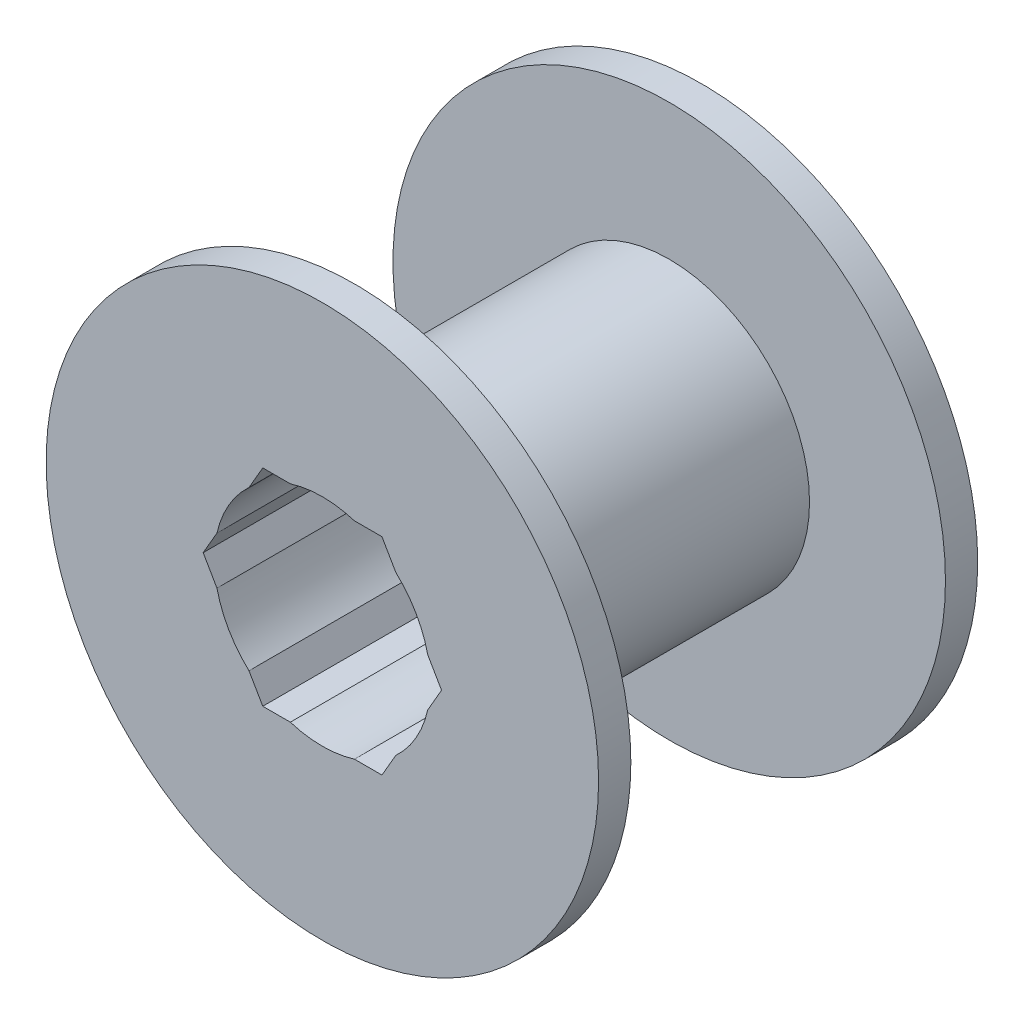
ISO-10303-21;
HEADER;
FILE_DESCRIPTION(('STEP AP214'),'2;1');
FILE_NAME('part.step','',(''),(''),'','','');
FILE_SCHEMA(('AUTOMOTIVE_DESIGN { 1 0 10303 214 1 1 1 1 }'));
ENDSEC;
DATA;
#1=APPLICATION_CONTEXT('core data for automotive mechanical design processes');
#2=APPLICATION_PROTOCOL_DEFINITION('international standard','automotive_design',2000,#1);
#3=PRODUCT_CONTEXT('',#1,'mechanical');
#4=PRODUCT('Part','Part','',(#3));
#5=PRODUCT_RELATED_PRODUCT_CATEGORY('part','',(#4));
#6=PRODUCT_DEFINITION_FORMATION('','',#4);
#7=PRODUCT_DEFINITION_CONTEXT('part definition',#1,'design');
#8=PRODUCT_DEFINITION('design','',#6,#7);
#9=PRODUCT_DEFINITION_SHAPE('','',#8);
#10=(LENGTH_UNIT() NAMED_UNIT(*) SI_UNIT(.MILLI.,.METRE.));
#11=(NAMED_UNIT(*) PLANE_ANGLE_UNIT() SI_UNIT($,.RADIAN.));
#12=(NAMED_UNIT(*) SI_UNIT($,.STERADIAN.) SOLID_ANGLE_UNIT());
#13=UNCERTAINTY_MEASURE_WITH_UNIT(LENGTH_MEASURE(1.E-05),#10,'distance_accuracy_value','');
#14=(GEOMETRIC_REPRESENTATION_CONTEXT(3) GLOBAL_UNCERTAINTY_ASSIGNED_CONTEXT((#13)) GLOBAL_UNIT_ASSIGNED_CONTEXT((#10,
#11,#12)) REPRESENTATION_CONTEXT('',''));
#15=CARTESIAN_POINT('',(0.,0.,0.));
#16=DIRECTION('',(0.,0.,1.));
#17=DIRECTION('',(1.,0.,0.));
#18=AXIS2_PLACEMENT_3D('',#15,#16,#17);
#19=CARTESIAN_POINT('',(0.,0.,33.4489208633094));
#20=DIRECTION('',(0.,0.,1.));
#21=DIRECTION('',(1.,0.,0.));
#22=AXIS2_PLACEMENT_3D('',#19,#20,#21);
#23=CYLINDRICAL_SURFACE('',#22,9.35);
#24=CARTESIAN_POINT('',(0.,0.,16.4));
#25=DIRECTION('',(0.,0.,1.));
#26=DIRECTION('',(1.,0.,0.));
#27=AXIS2_PLACEMENT_3D('',#24,#25,#26);
#28=CIRCLE('',#27,9.35);
#29=CARTESIAN_POINT('',(9.11903097858198,2.06537502930149,16.4));
#30=VERTEX_POINT('',#29);
#31=CARTESIAN_POINT('',(6.34818273300811,6.86462497069852,16.4));
#32=VERTEX_POINT('',#31);
#33=EDGE_CURVE('E268',#30,#32,#28,.T.);
#34=ORIENTED_EDGE('',*,*,#33,.T.);
#35=DIRECTION('',(0.,0.,1.));
#36=VECTOR('',#35,1.);
#37=CARTESIAN_POINT('',(6.3481827330081,6.86462497069852,33.4489208633094));
#38=LINE('',#37,#36);
#39=CARTESIAN_POINT('',(6.3481827330081,6.86462497069852,-16.4));
#40=VERTEX_POINT('',#39);
#41=EDGE_CURVE('E262',#32,#40,#38,.F.);
#42=ORIENTED_EDGE('',*,*,#41,.T.);
#43=CARTESIAN_POINT('',(0.,0.,-16.4));
#44=DIRECTION('',(0.,0.,1.));
#45=DIRECTION('',(1.,0.,0.));
#46=AXIS2_PLACEMENT_3D('',#43,#44,#45);
#47=CIRCLE('',#46,9.35);
#48=CARTESIAN_POINT('',(9.11903097858198,2.06537502930148,-16.4));
#49=VERTEX_POINT('',#48);
#50=EDGE_CURVE('E189',#49,#40,#47,.T.);
#51=ORIENTED_EDGE('',*,*,#50,.F.);
#52=DIRECTION('',(0.,0.,1.));
#53=VECTOR('',#52,1.);
#54=CARTESIAN_POINT('',(9.11903097858198,2.06537502930148,33.4489208633094));
#55=LINE('',#54,#53);
#56=EDGE_CURVE('E259',#49,#30,#55,.T.);
#57=ORIENTED_EDGE('',*,*,#56,.T.);
#58=EDGE_LOOP('',(#34,#42,#51,#57));
#59=FACE_BOUND('',#58,.T.);
#60=ADVANCED_FACE('F41',(#59),#23,.F.);
#61=CARTESIAN_POINT('',(6.34818273300809,-6.86462497069853,16.4));
#62=VERTEX_POINT('',#61);
#63=CARTESIAN_POINT('',(9.11903097858198,-2.06537502930147,16.4));
#64=VERTEX_POINT('',#63);
#65=EDGE_CURVE('E267',#62,#64,#28,.T.);
#66=ORIENTED_EDGE('',*,*,#65,.T.);
#67=DIRECTION('',(0.,0.,1.));
#68=VECTOR('',#67,1.);
#69=CARTESIAN_POINT('',(9.11903097858198,-2.06537502930147,33.4489208633094));
#70=LINE('',#69,#68);
#71=CARTESIAN_POINT('',(9.11903097858198,-2.06537502930147,-16.4));
#72=VERTEX_POINT('',#71);
#73=EDGE_CURVE('E64',#64,#72,#70,.F.);
#74=ORIENTED_EDGE('',*,*,#73,.T.);
#75=CARTESIAN_POINT('',(6.34818273300809,-6.86462497069853,-16.4));
#76=VERTEX_POINT('',#75);
#77=EDGE_CURVE('E271',#76,#72,#47,.T.);
#78=ORIENTED_EDGE('',*,*,#77,.F.);
#79=DIRECTION('',(0.,0.,1.));
#80=VECTOR('',#79,1.);
#81=CARTESIAN_POINT('',(6.34818273300809,-6.86462497069853,33.4489208633094));
#82=LINE('',#81,#80);
#83=EDGE_CURVE('E255',#76,#62,#82,.T.);
#84=ORIENTED_EDGE('',*,*,#83,.T.);
#85=EDGE_LOOP('',(#66,#74,#78,#84));
#86=FACE_BOUND('',#85,.T.);
#87=ADVANCED_FACE('F320',(#86),#23,.F.);
#88=CARTESIAN_POINT('',(-2.77084824557389,-8.93,16.4));
#89=VERTEX_POINT('',#88);
#90=CARTESIAN_POINT('',(2.77084824557389,-8.93,16.4));
#91=VERTEX_POINT('',#90);
#92=EDGE_CURVE('E308',#89,#91,#28,.T.);
#93=ORIENTED_EDGE('',*,*,#92,.T.);
#94=DIRECTION('',(0.,0.,1.));
#95=VECTOR('',#94,1.);
#96=CARTESIAN_POINT('',(2.77084824557389,-8.93,33.4489208633094));
#97=LINE('',#96,#95);
#98=CARTESIAN_POINT('',(2.77084824557389,-8.93,-16.4));
#99=VERTEX_POINT('',#98);
#100=EDGE_CURVE('E252',#91,#99,#97,.F.);
#101=ORIENTED_EDGE('',*,*,#100,.T.);
#102=CARTESIAN_POINT('',(-2.77084824557389,-8.93,-16.4));
#103=VERTEX_POINT('',#102);
#104=EDGE_CURVE('E330',#103,#99,#47,.T.);
#105=ORIENTED_EDGE('',*,*,#104,.F.);
#106=DIRECTION('',(0.,0.,1.));
#107=VECTOR('',#106,1.);
#108=CARTESIAN_POINT('',(-2.77084824557389,-8.93,33.4489208633094));
#109=LINE('',#108,#107);
#110=EDGE_CURVE('E249',#103,#89,#109,.T.);
#111=ORIENTED_EDGE('',*,*,#110,.T.);
#112=EDGE_LOOP('',(#93,#101,#105,#111));
#113=FACE_BOUND('',#112,.T.);
#114=ADVANCED_FACE('F312',(#113),#23,.F.);
#115=CARTESIAN_POINT('',(-9.11903097858198,-2.06537502930147,16.4));
#116=VERTEX_POINT('',#115);
#117=CARTESIAN_POINT('',(-6.34818273300809,-6.86462497069853,16.4));
#118=VERTEX_POINT('',#117);
#119=EDGE_CURVE('E315',#116,#118,#28,.T.);
#120=ORIENTED_EDGE('',*,*,#119,.T.);
#121=DIRECTION('',(0.,0.,1.));
#122=VECTOR('',#121,1.);
#123=CARTESIAN_POINT('',(-6.34818273300808,-6.86462497069855,33.4489208633094));
#124=LINE('',#123,#122);
#125=CARTESIAN_POINT('',(-6.34818273300808,-6.86462497069855,-16.4));
#126=VERTEX_POINT('',#125);
#127=EDGE_CURVE('E246',#118,#126,#124,.F.);
#128=ORIENTED_EDGE('',*,*,#127,.T.);
#129=CARTESIAN_POINT('',(-9.11903097858199,-2.06537502930145,-16.4));
#130=VERTEX_POINT('',#129);
#131=EDGE_CURVE('E331',#130,#126,#47,.T.);
#132=ORIENTED_EDGE('',*,*,#131,.F.);
#133=DIRECTION('',(0.,0.,1.));
#134=VECTOR('',#133,1.);
#135=CARTESIAN_POINT('',(-9.11903097858199,-2.06537502930145,33.4489208633094));
#136=LINE('',#135,#134);
#137=EDGE_CURVE('E243',#130,#116,#136,.T.);
#138=ORIENTED_EDGE('',*,*,#137,.T.);
#139=EDGE_LOOP('',(#120,#128,#132,#138));
#140=FACE_BOUND('',#139,.T.);
#141=ADVANCED_FACE('F362',(#140),#23,.F.);
#142=CARTESIAN_POINT('',(-6.34818273300809,6.86462497069853,16.4));
#143=VERTEX_POINT('',#142);
#144=CARTESIAN_POINT('',(-9.11903097858198,2.06537502930147,16.4));
#145=VERTEX_POINT('',#144);
#146=EDGE_CURVE('E317',#143,#145,#28,.T.);
#147=ORIENTED_EDGE('',*,*,#146,.T.);
#148=DIRECTION('',(0.,0.,1.));
#149=VECTOR('',#148,1.);
#150=CARTESIAN_POINT('',(-9.11903097858198,2.06537502930146,33.4489208633094));
#151=LINE('',#150,#149);
#152=CARTESIAN_POINT('',(-9.11903097858198,2.06537502930146,-16.4));
#153=VERTEX_POINT('',#152);
#154=EDGE_CURVE('E240',#145,#153,#151,.F.);
#155=ORIENTED_EDGE('',*,*,#154,.T.);
#156=CARTESIAN_POINT('',(-6.34818273300809,6.86462497069853,-16.4));
#157=VERTEX_POINT('',#156);
#158=EDGE_CURVE('E333',#157,#153,#47,.T.);
#159=ORIENTED_EDGE('',*,*,#158,.F.);
#160=DIRECTION('',(0.,0.,1.));
#161=VECTOR('',#160,1.);
#162=CARTESIAN_POINT('',(-6.34818273300809,6.86462497069853,33.4489208633094));
#163=LINE('',#162,#161);
#164=EDGE_CURVE('E237',#157,#143,#163,.T.);
#165=ORIENTED_EDGE('',*,*,#164,.T.);
#166=EDGE_LOOP('',(#147,#155,#159,#165));
#167=FACE_BOUND('',#166,.T.);
#168=ADVANCED_FACE('F353',(#167),#23,.F.);
#169=CARTESIAN_POINT('',(0.,0.,33.4489208633094));
#170=DIRECTION('',(0.,0.,1.));
#171=DIRECTION('',(1.,0.,0.));
#172=AXIS2_PLACEMENT_3D('',#169,#170,#171);
#173=CYLINDRICAL_SURFACE('',#172,23.9);
#174=CARTESIAN_POINT('',(0.,0.,16.4));
#175=DIRECTION('',(0.,0.,1.));
#176=DIRECTION('',(1.,0.,0.));
#177=AXIS2_PLACEMENT_3D('',#174,#175,#176);
#178=CIRCLE('',#177,23.9);
#179=CARTESIAN_POINT('',(23.9,0.,16.4));
#180=VERTEX_POINT('',#179);
#181=EDGE_CURVE('E264',#180,#180,#178,.T.);
#182=ORIENTED_EDGE('',*,*,#181,.F.);
#183=EDGE_LOOP('',(#182));
#184=FACE_BOUND('',#183,.T.);
#185=CARTESIAN_POINT('',(0.,0.,13.61));
#186=DIRECTION('',(0.,0.,1.));
#187=DIRECTION('',(1.,0.,0.));
#188=AXIS2_PLACEMENT_3D('',#185,#186,#187);
#189=CIRCLE('',#188,23.9);
#190=CARTESIAN_POINT('',(23.9,0.,13.61));
#191=VERTEX_POINT('',#190);
#192=EDGE_CURVE('E287',#191,#191,#189,.T.);
#193=ORIENTED_EDGE('',*,*,#192,.T.);
#194=EDGE_LOOP('',(#193));
#195=FACE_BOUND('',#194,.T.);
#196=ADVANCED_FACE('F43',(#184,#195),#173,.T.);
#197=CARTESIAN_POINT('',(0.,23.9,13.61));
#198=DIRECTION('',(0.,0.,1.));
#199=DIRECTION('',(1.,0.,0.));
#200=AXIS2_PLACEMENT_3D('',#197,#198,#199);
#201=PLANE('',#200);
#202=ORIENTED_EDGE('',*,*,#192,.F.);
#203=EDGE_LOOP('',(#202));
#204=FACE_BOUND('',#203,.T.);
#205=CARTESIAN_POINT('',(0.,0.,13.61));
#206=DIRECTION('',(0.,0.,1.));
#207=DIRECTION('',(1.,0.,0.));
#208=AXIS2_PLACEMENT_3D('',#205,#206,#207);
#209=CIRCLE('',#208,12.14);
#210=CARTESIAN_POINT('',(12.14,0.,13.61));
#211=VERTEX_POINT('',#210);
#212=EDGE_CURVE('E284',#211,#211,#209,.T.);
#213=ORIENTED_EDGE('',*,*,#212,.T.);
#214=EDGE_LOOP('',(#213));
#215=FACE_BOUND('',#214,.T.);
#216=ADVANCED_FACE('F399',(#204,#215),#201,.F.);
#217=CARTESIAN_POINT('',(0.,0.,33.4489208633094));
#218=DIRECTION('',(0.,0.,1.));
#219=DIRECTION('',(1.,0.,0.));
#220=AXIS2_PLACEMENT_3D('',#217,#218,#219);
#221=CYLINDRICAL_SURFACE('',#220,12.14);
#222=ORIENTED_EDGE('',*,*,#212,.F.);
#223=EDGE_LOOP('',(#222));
#224=FACE_BOUND('',#223,.T.);
#225=CARTESIAN_POINT('',(0.,0.,-13.61));
#226=DIRECTION('',(0.,0.,1.));
#227=DIRECTION('',(1.,0.,0.));
#228=AXIS2_PLACEMENT_3D('',#225,#226,#227);
#229=CIRCLE('',#228,12.14);
#230=CARTESIAN_POINT('',(12.14,0.,-13.61));
#231=VERTEX_POINT('',#230);
#232=EDGE_CURVE('E281',#231,#231,#229,.T.);
#233=ORIENTED_EDGE('',*,*,#232,.T.);
#234=EDGE_LOOP('',(#233));
#235=FACE_BOUND('',#234,.T.);
#236=ADVANCED_FACE('F542',(#224,#235),#221,.T.);
#237=CARTESIAN_POINT('',(0.,12.14,-13.61));
#238=DIRECTION('',(0.,0.,-1.));
#239=DIRECTION('',(-1.,0.,0.));
#240=AXIS2_PLACEMENT_3D('',#237,#238,#239);
#241=PLANE('',#240);
#242=ORIENTED_EDGE('',*,*,#232,.F.);
#243=EDGE_LOOP('',(#242));
#244=FACE_BOUND('',#243,.T.);
#245=CARTESIAN_POINT('',(0.,0.,-13.61));
#246=DIRECTION('',(0.,0.,1.));
#247=DIRECTION('',(1.,0.,0.));
#248=AXIS2_PLACEMENT_3D('',#245,#246,#247);
#249=CIRCLE('',#248,23.9);
#250=CARTESIAN_POINT('',(23.9,0.,-13.61));
#251=VERTEX_POINT('',#250);
#252=EDGE_CURVE('E278',#251,#251,#249,.T.);
#253=ORIENTED_EDGE('',*,*,#252,.T.);
#254=EDGE_LOOP('',(#253));
#255=FACE_BOUND('',#254,.T.);
#256=ADVANCED_FACE('F532',(#244,#255),#241,.F.);
#257=CARTESIAN_POINT('',(0.,0.,33.4489208633094));
#258=DIRECTION('',(0.,0.,1.));
#259=DIRECTION('',(1.,0.,0.));
#260=AXIS2_PLACEMENT_3D('',#257,#258,#259);
#261=CYLINDRICAL_SURFACE('',#260,23.9);
#262=ORIENTED_EDGE('',*,*,#252,.F.);
#263=EDGE_LOOP('',(#262));
#264=FACE_BOUND('',#263,.T.);
#265=CARTESIAN_POINT('',(0.,0.,-16.4));
#266=DIRECTION('',(0.,0.,1.));
#267=DIRECTION('',(1.,0.,0.));
#268=AXIS2_PLACEMENT_3D('',#265,#266,#267);
#269=CIRCLE('',#268,23.9);
#270=CARTESIAN_POINT('',(23.9,0.,-16.4));
#271=VERTEX_POINT('',#270);
#272=EDGE_CURVE('E274',#271,#271,#269,.T.);
#273=ORIENTED_EDGE('',*,*,#272,.T.);
#274=EDGE_LOOP('',(#273));
#275=FACE_BOUND('',#274,.T.);
#276=ADVANCED_FACE('F392',(#264,#275),#261,.T.);
#277=CARTESIAN_POINT('',(0.,23.9,-16.4));
#278=DIRECTION('',(0.,0.,1.));
#279=DIRECTION('',(1.,0.,0.));
#280=AXIS2_PLACEMENT_3D('',#277,#278,#279);
#281=PLANE('',#280);
#282=ORIENTED_EDGE('',*,*,#272,.F.);
#283=EDGE_LOOP('',(#282));
#284=FACE_BOUND('',#283,.T.);
#285=DIRECTION('',(0.5,0.866025403784439,0.));
#286=VECTOR('',#285,1.);
#287=CARTESIAN_POINT('',(5.15573790386336,-8.93,-16.4));
#288=LINE('',#287,#286);
#289=CARTESIAN_POINT('',(10.3114758077267,0.,-16.4));
#290=VERTEX_POINT('',#289);
#291=EDGE_CURVE('E207',#72,#290,#288,.T.);
#292=ORIENTED_EDGE('',*,*,#291,.T.);
#293=DIRECTION('',(-0.5,0.866025403784439,0.));
#294=VECTOR('',#293,1.);
#295=CARTESIAN_POINT('',(10.3114758077267,0.,-16.4));
#296=LINE('',#295,#294);
#297=EDGE_CURVE('E190',#290,#49,#296,.T.);
#298=ORIENTED_EDGE('',*,*,#297,.T.);
#299=ORIENTED_EDGE('',*,*,#50,.T.);
#300=CARTESIAN_POINT('',(5.15573790386337,8.93,-16.4));
#301=VERTEX_POINT('',#300);
#302=EDGE_CURVE('E165',#40,#301,#296,.T.);
#303=ORIENTED_EDGE('',*,*,#302,.T.);
#304=DIRECTION('',(-1.,0.,0.));
#305=VECTOR('',#304,1.);
#306=CARTESIAN_POINT('',(5.15573790386337,8.93,-16.4));
#307=LINE('',#306,#305);
#308=CARTESIAN_POINT('',(2.7708482455739,8.93,-16.4));
#309=VERTEX_POINT('',#308);
#310=EDGE_CURVE('E174',#301,#309,#307,.T.);
#311=ORIENTED_EDGE('',*,*,#310,.T.);
#312=CARTESIAN_POINT('',(-2.77084824557389,8.93,-16.4));
#313=VERTEX_POINT('',#312);
#314=EDGE_CURVE('E275',#309,#313,#47,.T.);
#315=ORIENTED_EDGE('',*,*,#314,.T.);
#316=CARTESIAN_POINT('',(-5.15573790386336,8.93,-16.4));
#317=VERTEX_POINT('',#316);
#318=EDGE_CURVE('E182',#313,#317,#307,.T.);
#319=ORIENTED_EDGE('',*,*,#318,.T.);
#320=DIRECTION('',(-0.5,-0.866025403784439,0.));
#321=VECTOR('',#320,1.);
#322=CARTESIAN_POINT('',(-5.15573790386336,8.93,-16.4));
#323=LINE('',#322,#321);
#324=EDGE_CURVE('E196',#317,#157,#323,.T.);
#325=ORIENTED_EDGE('',*,*,#324,.T.);
#326=ORIENTED_EDGE('',*,*,#158,.T.);
#327=CARTESIAN_POINT('',(-10.3114758077267,0.,-16.4));
#328=VERTEX_POINT('',#327);
#329=EDGE_CURVE('E181',#153,#328,#323,.T.);
#330=ORIENTED_EDGE('',*,*,#329,.T.);
#331=DIRECTION('',(0.5,-0.866025403784439,0.));
#332=VECTOR('',#331,1.);
#333=CARTESIAN_POINT('',(-10.3114758077267,0.,-16.4));
#334=LINE('',#333,#332);
#335=EDGE_CURVE('E200',#328,#130,#334,.T.);
#336=ORIENTED_EDGE('',*,*,#335,.T.);
#337=ORIENTED_EDGE('',*,*,#131,.T.);
#338=CARTESIAN_POINT('',(-5.15573790386335,-8.93,-16.4));
#339=VERTEX_POINT('',#338);
#340=EDGE_CURVE('E199',#126,#339,#334,.T.);
#341=ORIENTED_EDGE('',*,*,#340,.T.);
#342=DIRECTION('',(1.,0.,0.));
#343=VECTOR('',#342,1.);
#344=CARTESIAN_POINT('',(-5.15573790386335,-8.93,-16.4));
#345=LINE('',#344,#343);
#346=EDGE_CURVE('E204',#339,#103,#345,.T.);
#347=ORIENTED_EDGE('',*,*,#346,.T.);
#348=ORIENTED_EDGE('',*,*,#104,.T.);
#349=CARTESIAN_POINT('',(5.15573790386336,-8.93,-16.4));
#350=VERTEX_POINT('',#349);
#351=EDGE_CURVE('E203',#99,#350,#345,.T.);
#352=ORIENTED_EDGE('',*,*,#351,.T.);
#353=EDGE_CURVE('E171',#350,#76,#288,.T.);
#354=ORIENTED_EDGE('',*,*,#353,.T.);
#355=ORIENTED_EDGE('',*,*,#77,.T.);
#356=EDGE_LOOP('',(#292,#298,#299,#303,#311,#315,#319,#325,#326,#330,#336,#337,#341,#347,#348,
#352,#354,#355));
#357=FACE_BOUND('',#356,.T.);
#358=ADVANCED_FACE('F186',(#284,#357),#281,.F.);
#359=CARTESIAN_POINT('',(2.77084824557389,8.93,16.4));
#360=VERTEX_POINT('',#359);
#361=CARTESIAN_POINT('',(-2.77084824557389,8.93,16.4));
#362=VERTEX_POINT('',#361);
#363=EDGE_CURVE('E272',#360,#362,#28,.T.);
#364=ORIENTED_EDGE('',*,*,#363,.T.);
#365=DIRECTION('',(0.,0.,1.));
#366=VECTOR('',#365,1.);
#367=CARTESIAN_POINT('',(-2.77084824557389,8.93,33.4489208633094));
#368=LINE('',#367,#366);
#369=EDGE_CURVE('E234',#362,#313,#368,.F.);
#370=ORIENTED_EDGE('',*,*,#369,.T.);
#371=ORIENTED_EDGE('',*,*,#314,.F.);
#372=DIRECTION('',(0.,0.,1.));
#373=VECTOR('',#372,1.);
#374=CARTESIAN_POINT('',(2.7708482455739,8.93,33.4489208633094));
#375=LINE('',#374,#373);
#376=EDGE_CURVE('E177',#309,#360,#375,.T.);
#377=ORIENTED_EDGE('',*,*,#376,.T.);
#378=EDGE_LOOP('',(#364,#370,#371,#377));
#379=FACE_BOUND('',#378,.T.);
#380=ADVANCED_FACE('F342',(#379),#23,.F.);
#381=CARTESIAN_POINT('',(0.,9.35,16.4));
#382=DIRECTION('',(0.,0.,-1.));
#383=DIRECTION('',(-1.,0.,0.));
#384=AXIS2_PLACEMENT_3D('',#381,#382,#383);
#385=PLANE('',#384);
#386=ORIENTED_EDGE('',*,*,#33,.F.);
#387=DIRECTION('',(-0.5,0.866025403784439,0.));
#388=VECTOR('',#387,1.);
#389=CARTESIAN_POINT('',(10.3114758077267,0.,16.4));
#390=LINE('',#389,#388);
#391=CARTESIAN_POINT('',(10.3114758077267,0.,16.4));
#392=VERTEX_POINT('',#391);
#393=EDGE_CURVE('E210',#392,#30,#390,.T.);
#394=ORIENTED_EDGE('',*,*,#393,.F.);
#395=DIRECTION('',(-0.5,-0.866025403784439,0.));
#396=VECTOR('',#395,1.);
#397=CARTESIAN_POINT('',(11.7822756184873,2.54749999999999,16.4));
#398=LINE('',#397,#396);
#399=EDGE_CURVE('E11',#392,#64,#398,.T.);
#400=ORIENTED_EDGE('',*,*,#399,.T.);
#401=ORIENTED_EDGE('',*,*,#65,.F.);
#402=DIRECTION('',(0.5,0.866025403784439,0.));
#403=VECTOR('',#402,1.);
#404=CARTESIAN_POINT('',(5.15573790386336,-8.93,16.4));
#405=LINE('',#404,#403);
#406=CARTESIAN_POINT('',(5.15573790386336,-8.93,16.4));
#407=VERTEX_POINT('',#406);
#408=EDGE_CURVE('E191',#407,#62,#405,.T.);
#409=ORIENTED_EDGE('',*,*,#408,.F.);
#410=DIRECTION('',(-1.,0.,0.));
#411=VECTOR('',#410,1.);
#412=CARTESIAN_POINT('',(0.,-8.93,16.4));
#413=LINE('',#412,#411);
#414=EDGE_CURVE('E49',#407,#91,#413,.T.);
#415=ORIENTED_EDGE('',*,*,#414,.T.);
#416=ORIENTED_EDGE('',*,*,#92,.F.);
#417=DIRECTION('',(1.,0.,0.));
#418=VECTOR('',#417,1.);
#419=CARTESIAN_POINT('',(-5.15573790386335,-8.93,16.4));
#420=LINE('',#419,#418);
#421=CARTESIAN_POINT('',(-5.15573790386335,-8.93,16.4));
#422=VERTEX_POINT('',#421);
#423=EDGE_CURVE('E193',#422,#89,#420,.T.);
#424=ORIENTED_EDGE('',*,*,#423,.F.);
#425=DIRECTION('',(-0.5,0.866025403784439,0.));
#426=VECTOR('',#425,1.);
#427=CARTESIAN_POINT('',(-11.7822756184873,2.5475,16.4));
#428=LINE('',#427,#426);
#429=EDGE_CURVE('E297',#422,#118,#428,.T.);
#430=ORIENTED_EDGE('',*,*,#429,.T.);
#431=ORIENTED_EDGE('',*,*,#119,.F.);
#432=DIRECTION('',(0.5,-0.866025403784439,0.));
#433=VECTOR('',#432,1.);
#434=CARTESIAN_POINT('',(-10.3114758077267,0.,16.4));
#435=LINE('',#434,#433);
#436=CARTESIAN_POINT('',(-10.3114758077267,0.,16.4));
#437=VERTEX_POINT('',#436);
#438=EDGE_CURVE('E216',#437,#116,#435,.T.);
#439=ORIENTED_EDGE('',*,*,#438,.F.);
#440=DIRECTION('',(0.5,0.866025403784439,0.));
#441=VECTOR('',#440,1.);
#442=CARTESIAN_POINT('',(-3.68493809310279,11.4775,16.4));
#443=LINE('',#442,#441);
#444=EDGE_CURVE('E293',#437,#145,#443,.T.);
#445=ORIENTED_EDGE('',*,*,#444,.T.);
#446=ORIENTED_EDGE('',*,*,#146,.F.);
#447=DIRECTION('',(-0.5,-0.866025403784439,0.));
#448=VECTOR('',#447,1.);
#449=CARTESIAN_POINT('',(-5.15573790386336,8.93,16.4));
#450=LINE('',#449,#448);
#451=CARTESIAN_POINT('',(-5.15573790386336,8.93,16.4));
#452=VERTEX_POINT('',#451);
#453=EDGE_CURVE('E214',#452,#143,#450,.T.);
#454=ORIENTED_EDGE('',*,*,#453,.F.);
#455=DIRECTION('',(1.,0.,0.));
#456=VECTOR('',#455,1.);
#457=CARTESIAN_POINT('',(0.,8.93,16.4));
#458=LINE('',#457,#456);
#459=EDGE_CURVE('E290',#452,#362,#458,.T.);
#460=ORIENTED_EDGE('',*,*,#459,.T.);
#461=ORIENTED_EDGE('',*,*,#363,.F.);
#462=DIRECTION('',(-1.,0.,0.));
#463=VECTOR('',#462,1.);
#464=CARTESIAN_POINT('',(5.15573790386337,8.93,16.4));
#465=LINE('',#464,#463);
#466=CARTESIAN_POINT('',(5.15573790386337,8.93,16.4));
#467=VERTEX_POINT('',#466);
#468=EDGE_CURVE('E212',#467,#360,#465,.T.);
#469=ORIENTED_EDGE('',*,*,#468,.F.);
#470=DIRECTION('',(0.5,-0.866025403784439,0.));
#471=VECTOR('',#470,1.);
#472=CARTESIAN_POINT('',(3.68493809310279,11.4775,16.4));
#473=LINE('',#472,#471);
#474=EDGE_CURVE('E168',#467,#32,#473,.T.);
#475=ORIENTED_EDGE('',*,*,#474,.T.);
#476=EDGE_LOOP('',(#386,#394,#400,#401,#409,#415,#416,#424,#430,#431,#439,#445,#446,#454,#460,
#461,#469,#475));
#477=FACE_BOUND('',#476,.T.);
#478=ORIENTED_EDGE('',*,*,#181,.T.);
#479=EDGE_LOOP('',(#478));
#480=FACE_BOUND('',#479,.T.);
#481=ADVANCED_FACE('F305',(#477,#480),#385,.F.);
#482=CARTESIAN_POINT('',(5.15573790386337,8.93,-16.4));
#483=DIRECTION('',(0.,1.,0.));
#484=DIRECTION('',(-1.,0.,0.));
#485=AXIS2_PLACEMENT_3D('',#482,#483,#484);
#486=PLANE('',#485);
#487=ORIENTED_EDGE('',*,*,#310,.F.);
#488=DIRECTION('',(0.,0.,1.));
#489=VECTOR('',#488,1.);
#490=CARTESIAN_POINT('',(5.15573790386337,8.93,-16.4));
#491=LINE('',#490,#489);
#492=EDGE_CURVE('E56',#301,#467,#491,.T.);
#493=ORIENTED_EDGE('',*,*,#492,.T.);
#494=ORIENTED_EDGE('',*,*,#468,.T.);
#495=ORIENTED_EDGE('',*,*,#376,.F.);
#496=EDGE_LOOP('',(#487,#493,#494,#495));
#497=FACE_BOUND('',#496,.T.);
#498=ADVANCED_FACE('F175',(#497),#486,.F.);
#499=CARTESIAN_POINT('',(10.3114758077267,0.,-16.4));
#500=DIRECTION('',(0.866025403784439,0.5,0.));
#501=DIRECTION('',(-0.5,0.866025403784439,0.));
#502=AXIS2_PLACEMENT_3D('',#499,#500,#501);
#503=PLANE('',#502);
#504=ORIENTED_EDGE('',*,*,#474,.F.);
#505=ORIENTED_EDGE('',*,*,#492,.F.);
#506=ORIENTED_EDGE('',*,*,#302,.F.);
#507=ORIENTED_EDGE('',*,*,#41,.F.);
#508=EDGE_LOOP('',(#504,#505,#506,#507));
#509=FACE_BOUND('',#508,.T.);
#510=ADVANCED_FACE('F163',(#509),#503,.F.);
#511=ORIENTED_EDGE('',*,*,#459,.F.);
#512=DIRECTION('',(0.,0.,1.));
#513=VECTOR('',#512,1.);
#514=CARTESIAN_POINT('',(-5.15573790386336,8.93,-16.4));
#515=LINE('',#514,#513);
#516=EDGE_CURVE('E170',#317,#452,#515,.T.);
#517=ORIENTED_EDGE('',*,*,#516,.F.);
#518=ORIENTED_EDGE('',*,*,#318,.F.);
#519=ORIENTED_EDGE('',*,*,#369,.F.);
#520=EDGE_LOOP('',(#511,#517,#518,#519));
#521=FACE_BOUND('',#520,.T.);
#522=ADVANCED_FACE('F345',(#521),#486,.F.);
#523=CARTESIAN_POINT('',(-5.15573790386336,8.93,-16.4));
#524=DIRECTION('',(-0.866025403784439,0.5,0.));
#525=DIRECTION('',(-0.5,-0.866025403784439,0.));
#526=AXIS2_PLACEMENT_3D('',#523,#524,#525);
#527=PLANE('',#526);
#528=ORIENTED_EDGE('',*,*,#324,.F.);
#529=ORIENTED_EDGE('',*,*,#516,.T.);
#530=ORIENTED_EDGE('',*,*,#453,.T.);
#531=ORIENTED_EDGE('',*,*,#164,.F.);
#532=EDGE_LOOP('',(#528,#529,#530,#531));
#533=FACE_BOUND('',#532,.T.);
#534=ADVANCED_FACE('F351',(#533),#527,.F.);
#535=ORIENTED_EDGE('',*,*,#444,.F.);
#536=DIRECTION('',(0.,0.,1.));
#537=VECTOR('',#536,1.);
#538=CARTESIAN_POINT('',(-10.3114758077267,0.,-16.4));
#539=LINE('',#538,#537);
#540=EDGE_CURVE('E228',#328,#437,#539,.T.);
#541=ORIENTED_EDGE('',*,*,#540,.F.);
#542=ORIENTED_EDGE('',*,*,#329,.F.);
#543=ORIENTED_EDGE('',*,*,#154,.F.);
#544=EDGE_LOOP('',(#535,#541,#542,#543));
#545=FACE_BOUND('',#544,.T.);
#546=ADVANCED_FACE('F355',(#545),#527,.F.);
#547=CARTESIAN_POINT('',(-10.3114758077267,0.,-16.4));
#548=DIRECTION('',(-0.866025403784439,-0.5,0.));
#549=DIRECTION('',(0.5,-0.866025403784439,0.));
#550=AXIS2_PLACEMENT_3D('',#547,#548,#549);
#551=PLANE('',#550);
#552=ORIENTED_EDGE('',*,*,#335,.F.);
#553=ORIENTED_EDGE('',*,*,#540,.T.);
#554=ORIENTED_EDGE('',*,*,#438,.T.);
#555=ORIENTED_EDGE('',*,*,#137,.F.);
#556=EDGE_LOOP('',(#552,#553,#554,#555));
#557=FACE_BOUND('',#556,.T.);
#558=ADVANCED_FACE('F360',(#557),#551,.F.);
#559=ORIENTED_EDGE('',*,*,#429,.F.);
#560=DIRECTION('',(0.,0.,1.));
#561=VECTOR('',#560,1.);
#562=CARTESIAN_POINT('',(-5.15573790386335,-8.93,-16.4));
#563=LINE('',#562,#561);
#564=EDGE_CURVE('E225',#339,#422,#563,.T.);
#565=ORIENTED_EDGE('',*,*,#564,.F.);
#566=ORIENTED_EDGE('',*,*,#340,.F.);
#567=ORIENTED_EDGE('',*,*,#127,.F.);
#568=EDGE_LOOP('',(#559,#565,#566,#567));
#569=FACE_BOUND('',#568,.T.);
#570=ADVANCED_FACE('F364',(#569),#551,.F.);
#571=CARTESIAN_POINT('',(-5.15573790386335,-8.93,-16.4));
#572=DIRECTION('',(0.,-1.,0.));
#573=DIRECTION('',(0.,0.,-1.));
#574=AXIS2_PLACEMENT_3D('',#571,#572,#573);
#575=PLANE('',#574);
#576=ORIENTED_EDGE('',*,*,#346,.F.);
#577=ORIENTED_EDGE('',*,*,#564,.T.);
#578=ORIENTED_EDGE('',*,*,#423,.T.);
#579=ORIENTED_EDGE('',*,*,#110,.F.);
#580=EDGE_LOOP('',(#576,#577,#578,#579));
#581=FACE_BOUND('',#580,.T.);
#582=ADVANCED_FACE('F367',(#581),#575,.F.);
#583=ORIENTED_EDGE('',*,*,#414,.F.);
#584=DIRECTION('',(0.,0.,1.));
#585=VECTOR('',#584,1.);
#586=CARTESIAN_POINT('',(5.15573790386336,-8.93,-16.4));
#587=LINE('',#586,#585);
#588=EDGE_CURVE('E222',#350,#407,#587,.T.);
#589=ORIENTED_EDGE('',*,*,#588,.F.);
#590=ORIENTED_EDGE('',*,*,#351,.F.);
#591=ORIENTED_EDGE('',*,*,#100,.F.);
#592=EDGE_LOOP('',(#583,#589,#590,#591));
#593=FACE_BOUND('',#592,.T.);
#594=ADVANCED_FACE('F369',(#593),#575,.F.);
#595=CARTESIAN_POINT('',(5.15573790386336,-8.93,-16.4));
#596=DIRECTION('',(0.866025403784439,-0.5,0.));
#597=DIRECTION('',(0.5,0.866025403784439,0.));
#598=AXIS2_PLACEMENT_3D('',#595,#596,#597);
#599=PLANE('',#598);
#600=ORIENTED_EDGE('',*,*,#353,.F.);
#601=ORIENTED_EDGE('',*,*,#588,.T.);
#602=ORIENTED_EDGE('',*,*,#408,.T.);
#603=ORIENTED_EDGE('',*,*,#83,.F.);
#604=EDGE_LOOP('',(#600,#601,#602,#603));
#605=FACE_BOUND('',#604,.T.);
#606=ADVANCED_FACE('F375',(#605),#599,.F.);
#607=ORIENTED_EDGE('',*,*,#297,.F.);
#608=DIRECTION('',(0.,0.,1.));
#609=VECTOR('',#608,1.);
#610=CARTESIAN_POINT('',(10.3114758077267,0.,-16.4));
#611=LINE('',#610,#609);
#612=EDGE_CURVE('E219',#290,#392,#611,.T.);
#613=ORIENTED_EDGE('',*,*,#612,.T.);
#614=ORIENTED_EDGE('',*,*,#393,.T.);
#615=ORIENTED_EDGE('',*,*,#56,.F.);
#616=EDGE_LOOP('',(#607,#613,#614,#615));
#617=FACE_BOUND('',#616,.T.);
#618=ADVANCED_FACE('F327',(#617),#503,.F.);
#619=ORIENTED_EDGE('',*,*,#399,.F.);
#620=ORIENTED_EDGE('',*,*,#612,.F.);
#621=ORIENTED_EDGE('',*,*,#291,.F.);
#622=ORIENTED_EDGE('',*,*,#73,.F.);
#623=EDGE_LOOP('',(#619,#620,#621,#622));
#624=FACE_BOUND('',#623,.T.);
#625=ADVANCED_FACE('F324',(#624),#599,.F.);
#626=CLOSED_SHELL('',(#60,#87,#114,#141,#168,#196,#216,#236,#256,#276,#358,#380,#481,#498,#510,
#522,#534,#546,#558,#570,#582,#594,#606,#618,#625));
#627=MANIFOLD_SOLID_BREP('B2',#626);
#628=ADVANCED_BREP_SHAPE_REPRESENTATION('',(#18,#627),#14);
#629=SHAPE_DEFINITION_REPRESENTATION(#9,#628);
ENDSEC;
END-ISO-10303-21;
